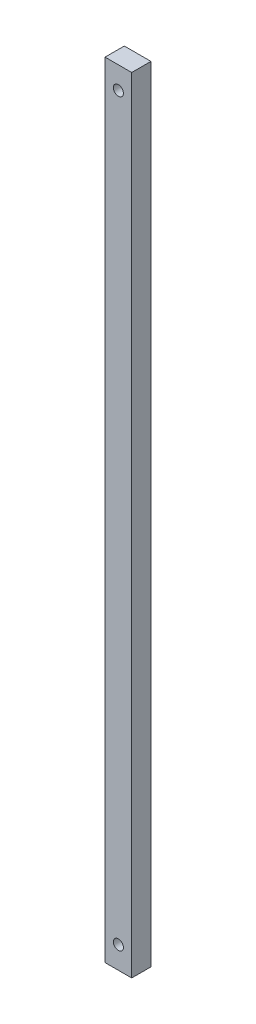
ISO-10303-21;
HEADER;
FILE_DESCRIPTION(('STEP AP214'),'2;1');
FILE_NAME('part.step','',(''),(''),'','','');
FILE_SCHEMA(('AUTOMOTIVE_DESIGN { 1 0 10303 214 1 1 1 1 }'));
ENDSEC;
DATA;
#1=APPLICATION_CONTEXT('core data for automotive mechanical design processes');
#2=APPLICATION_PROTOCOL_DEFINITION('international standard','automotive_design',2000,#1);
#3=PRODUCT_CONTEXT('',#1,'mechanical');
#4=PRODUCT('Part','Part','',(#3));
#5=PRODUCT_RELATED_PRODUCT_CATEGORY('part','',(#4));
#6=PRODUCT_DEFINITION_FORMATION('','',#4);
#7=PRODUCT_DEFINITION_CONTEXT('part definition',#1,'design');
#8=PRODUCT_DEFINITION('design','',#6,#7);
#9=PRODUCT_DEFINITION_SHAPE('','',#8);
#10=(LENGTH_UNIT() NAMED_UNIT(*) SI_UNIT(.MILLI.,.METRE.));
#11=(NAMED_UNIT(*) PLANE_ANGLE_UNIT() SI_UNIT($,.RADIAN.));
#12=(NAMED_UNIT(*) SI_UNIT($,.STERADIAN.) SOLID_ANGLE_UNIT());
#13=UNCERTAINTY_MEASURE_WITH_UNIT(LENGTH_MEASURE(1.E-05),#10,'distance_accuracy_value','');
#14=(GEOMETRIC_REPRESENTATION_CONTEXT(3) GLOBAL_UNCERTAINTY_ASSIGNED_CONTEXT((#13)) GLOBAL_UNIT_ASSIGNED_CONTEXT((#10,
#11,#12)) REPRESENTATION_CONTEXT('',''));
#15=CARTESIAN_POINT('',(0.,0.,0.));
#16=DIRECTION('',(0.,0.,1.));
#17=DIRECTION('',(1.,0.,0.));
#18=AXIS2_PLACEMENT_3D('',#15,#16,#17);
#19=CARTESIAN_POINT('',(0.,0.,6.5));
#20=DIRECTION('',(1.,0.,0.));
#21=DIRECTION('',(0.,1.,0.));
#22=AXIS2_PLACEMENT_3D('',#19,#20,#21);
#23=PLANE('',#22);
#24=DIRECTION('',(0.,-1.,0.));
#25=VECTOR('',#24,1.);
#26=CARTESIAN_POINT('',(0.,0.,0.));
#27=LINE('',#26,#25);
#28=CARTESIAN_POINT('',(0.,265.,0.));
#29=VERTEX_POINT('',#28);
#30=CARTESIAN_POINT('',(0.,0.,0.));
#31=VERTEX_POINT('',#30);
#32=EDGE_CURVE('E101',#29,#31,#27,.T.);
#33=ORIENTED_EDGE('',*,*,#32,.T.);
#34=DIRECTION('',(0.,0.,-1.));
#35=VECTOR('',#34,1.);
#36=CARTESIAN_POINT('',(0.,0.,6.5));
#37=LINE('',#36,#35);
#38=CARTESIAN_POINT('',(0.,0.,6.5));
#39=VERTEX_POINT('',#38);
#40=EDGE_CURVE('E11',#39,#31,#37,.T.);
#41=ORIENTED_EDGE('',*,*,#40,.F.);
#42=DIRECTION('',(0.,-1.,0.));
#43=VECTOR('',#42,1.);
#44=CARTESIAN_POINT('',(0.,0.,6.5));
#45=LINE('',#44,#43);
#46=CARTESIAN_POINT('',(0.,265.,6.5));
#47=VERTEX_POINT('',#46);
#48=EDGE_CURVE('E88',#47,#39,#45,.T.);
#49=ORIENTED_EDGE('',*,*,#48,.F.);
#50=DIRECTION('',(0.,0.,-1.));
#51=VECTOR('',#50,1.);
#52=CARTESIAN_POINT('',(0.,265.,6.5));
#53=LINE('',#52,#51);
#54=EDGE_CURVE('E97',#47,#29,#53,.T.);
#55=ORIENTED_EDGE('',*,*,#54,.T.);
#56=EDGE_LOOP('',(#33,#41,#49,#55));
#57=FACE_BOUND('',#56,.T.);
#58=ADVANCED_FACE('F35',(#57),#23,.F.);
#59=CARTESIAN_POINT('',(0.,0.,6.5));
#60=DIRECTION('',(0.,1.,0.));
#61=DIRECTION('',(0.,0.,1.));
#62=AXIS2_PLACEMENT_3D('',#59,#60,#61);
#63=PLANE('',#62);
#64=DIRECTION('',(1.,0.,0.));
#65=VECTOR('',#64,1.);
#66=CARTESIAN_POINT('',(0.,0.,0.));
#67=LINE('',#66,#65);
#68=CARTESIAN_POINT('',(9.,0.,0.));
#69=VERTEX_POINT('',#68);
#70=EDGE_CURVE('E92',#31,#69,#67,.T.);
#71=ORIENTED_EDGE('',*,*,#70,.T.);
#72=DIRECTION('',(0.,0.,-1.));
#73=VECTOR('',#72,1.);
#74=CARTESIAN_POINT('',(9.,0.,6.5));
#75=LINE('',#74,#73);
#76=CARTESIAN_POINT('',(9.,0.,6.5));
#77=VERTEX_POINT('',#76);
#78=EDGE_CURVE('E44',#77,#69,#75,.T.);
#79=ORIENTED_EDGE('',*,*,#78,.F.);
#80=DIRECTION('',(1.,0.,0.));
#81=VECTOR('',#80,1.);
#82=CARTESIAN_POINT('',(0.,0.,6.5));
#83=LINE('',#82,#81);
#84=EDGE_CURVE('E83',#39,#77,#83,.T.);
#85=ORIENTED_EDGE('',*,*,#84,.F.);
#86=ORIENTED_EDGE('',*,*,#40,.T.);
#87=EDGE_LOOP('',(#71,#79,#85,#86));
#88=FACE_BOUND('',#87,.T.);
#89=ADVANCED_FACE('F91',(#88),#63,.F.);
#90=CARTESIAN_POINT('',(9.,0.,6.5));
#91=DIRECTION('',(-1.,0.,0.));
#92=DIRECTION('',(0.,-1.,0.));
#93=AXIS2_PLACEMENT_3D('',#90,#91,#92);
#94=PLANE('',#93);
#95=DIRECTION('',(0.,1.,0.));
#96=VECTOR('',#95,1.);
#97=CARTESIAN_POINT('',(9.,0.,0.));
#98=LINE('',#97,#96);
#99=CARTESIAN_POINT('',(8.99999999999995,265.,0.));
#100=VERTEX_POINT('',#99);
#101=EDGE_CURVE('E70',#69,#100,#98,.T.);
#102=ORIENTED_EDGE('',*,*,#101,.T.);
#103=DIRECTION('',(0.,0.,-1.));
#104=VECTOR('',#103,1.);
#105=CARTESIAN_POINT('',(8.99999999999995,265.,6.5));
#106=LINE('',#105,#104);
#107=CARTESIAN_POINT('',(8.99999999999995,265.,6.5));
#108=VERTEX_POINT('',#107);
#109=EDGE_CURVE('E93',#108,#100,#106,.T.);
#110=ORIENTED_EDGE('',*,*,#109,.F.);
#111=DIRECTION('',(0.,1.,0.));
#112=VECTOR('',#111,1.);
#113=CARTESIAN_POINT('',(9.,0.,6.5));
#114=LINE('',#113,#112);
#115=EDGE_CURVE('E86',#77,#108,#114,.T.);
#116=ORIENTED_EDGE('',*,*,#115,.F.);
#117=ORIENTED_EDGE('',*,*,#78,.T.);
#118=EDGE_LOOP('',(#102,#110,#116,#117));
#119=FACE_BOUND('',#118,.T.);
#120=ADVANCED_FACE('F95',(#119),#94,.F.);
#121=CARTESIAN_POINT('',(0.,265.,6.5));
#122=DIRECTION('',(0.,-1.,0.));
#123=DIRECTION('',(0.,0.,-1.));
#124=AXIS2_PLACEMENT_3D('',#121,#122,#123);
#125=PLANE('',#124);
#126=DIRECTION('',(-1.,0.,0.));
#127=VECTOR('',#126,1.);
#128=CARTESIAN_POINT('',(0.,265.,0.));
#129=LINE('',#128,#127);
#130=EDGE_CURVE('E76',#100,#29,#129,.T.);
#131=ORIENTED_EDGE('',*,*,#130,.T.);
#132=ORIENTED_EDGE('',*,*,#54,.F.);
#133=DIRECTION('',(-1.,0.,0.));
#134=VECTOR('',#133,1.);
#135=CARTESIAN_POINT('',(0.,265.,6.5));
#136=LINE('',#135,#134);
#137=EDGE_CURVE('E53',#108,#47,#136,.T.);
#138=ORIENTED_EDGE('',*,*,#137,.F.);
#139=ORIENTED_EDGE('',*,*,#109,.T.);
#140=EDGE_LOOP('',(#131,#132,#138,#139));
#141=FACE_BOUND('',#140,.T.);
#142=ADVANCED_FACE('F145',(#141),#125,.F.);
#143=CARTESIAN_POINT('',(0.,0.,6.5));
#144=DIRECTION('',(0.,0.,-1.));
#145=DIRECTION('',(-1.,0.,0.));
#146=AXIS2_PLACEMENT_3D('',#143,#144,#145);
#147=PLANE('',#146);
#148=CARTESIAN_POINT('',(4.49999999999995,7.5,6.5));
#149=DIRECTION('',(0.,0.,-1.));
#150=DIRECTION('',(-1.,0.,0.));
#151=AXIS2_PLACEMENT_3D('',#148,#149,#150);
#152=CIRCLE('',#151,1.7);
#153=CARTESIAN_POINT('',(2.79999999999995,7.5,6.5));
#154=VERTEX_POINT('',#153);
#155=EDGE_CURVE('E38',#154,#154,#152,.T.);
#156=ORIENTED_EDGE('',*,*,#155,.T.);
#157=EDGE_LOOP('',(#156));
#158=FACE_BOUND('',#157,.T.);
#159=CARTESIAN_POINT('',(4.49999999999995,257.5,6.5));
#160=DIRECTION('',(0.,0.,-1.));
#161=DIRECTION('',(-1.,0.,0.));
#162=AXIS2_PLACEMENT_3D('',#159,#160,#161);
#163=CIRCLE('',#162,1.7);
#164=CARTESIAN_POINT('',(2.79999999999995,257.5,6.5));
#165=VERTEX_POINT('',#164);
#166=EDGE_CURVE('E104',#165,#165,#163,.T.);
#167=ORIENTED_EDGE('',*,*,#166,.T.);
#168=EDGE_LOOP('',(#167));
#169=FACE_BOUND('',#168,.T.);
#170=ORIENTED_EDGE('',*,*,#48,.T.);
#171=ORIENTED_EDGE('',*,*,#84,.T.);
#172=ORIENTED_EDGE('',*,*,#115,.T.);
#173=ORIENTED_EDGE('',*,*,#137,.T.);
#174=EDGE_LOOP('',(#170,#171,#172,#173));
#175=FACE_BOUND('',#174,.T.);
#176=ADVANCED_FACE('F84',(#158,#169,#175),#147,.F.);
#177=CARTESIAN_POINT('',(0.,0.,0.));
#178=DIRECTION('',(0.,0.,-1.));
#179=DIRECTION('',(-1.,0.,0.));
#180=AXIS2_PLACEMENT_3D('',#177,#178,#179);
#181=PLANE('',#180);
#182=CARTESIAN_POINT('',(4.49999999999995,7.5,0.));
#183=DIRECTION('',(0.,0.,-1.));
#184=DIRECTION('',(-1.,0.,0.));
#185=AXIS2_PLACEMENT_3D('',#182,#183,#184);
#186=CIRCLE('',#185,3.25);
#187=CARTESIAN_POINT('',(1.24999999999995,7.5,0.));
#188=VERTEX_POINT('',#187);
#189=EDGE_CURVE('E130',#188,#188,#186,.T.);
#190=ORIENTED_EDGE('',*,*,#189,.F.);
#191=EDGE_LOOP('',(#190));
#192=FACE_BOUND('',#191,.T.);
#193=CARTESIAN_POINT('',(4.49999999999995,257.5,0.));
#194=DIRECTION('',(0.,0.,-1.));
#195=DIRECTION('',(-1.,0.,0.));
#196=AXIS2_PLACEMENT_3D('',#193,#194,#195);
#197=CIRCLE('',#196,3.25);
#198=CARTESIAN_POINT('',(1.24999999999995,257.5,0.));
#199=VERTEX_POINT('',#198);
#200=EDGE_CURVE('E119',#199,#199,#197,.T.);
#201=ORIENTED_EDGE('',*,*,#200,.F.);
#202=EDGE_LOOP('',(#201));
#203=FACE_BOUND('',#202,.T.);
#204=ORIENTED_EDGE('',*,*,#32,.F.);
#205=ORIENTED_EDGE('',*,*,#130,.F.);
#206=ORIENTED_EDGE('',*,*,#101,.F.);
#207=ORIENTED_EDGE('',*,*,#70,.F.);
#208=EDGE_LOOP('',(#204,#205,#206,#207));
#209=FACE_BOUND('',#208,.T.);
#210=ADVANCED_FACE('F136',(#192,#203,#209),#181,.T.);
#211=CARTESIAN_POINT('',(4.49999999999995,257.5,0.));
#212=DIRECTION('',(0.,0.,-1.));
#213=DIRECTION('',(-1.,0.,0.));
#214=AXIS2_PLACEMENT_3D('',#211,#212,#213);
#215=CYLINDRICAL_SURFACE('',#214,1.7);
#216=CARTESIAN_POINT('',(4.49999999999995,257.5,3.4));
#217=DIRECTION('',(0.,0.,-1.));
#218=DIRECTION('',(-1.,0.,0.));
#219=AXIS2_PLACEMENT_3D('',#216,#217,#218);
#220=CIRCLE('',#219,1.7);
#221=CARTESIAN_POINT('',(2.79999999999995,257.5,3.4));
#222=VERTEX_POINT('',#221);
#223=EDGE_CURVE('E110',#222,#222,#220,.T.);
#224=ORIENTED_EDGE('',*,*,#223,.T.);
#225=EDGE_LOOP('',(#224));
#226=FACE_BOUND('',#225,.T.);
#227=ORIENTED_EDGE('',*,*,#166,.F.);
#228=EDGE_LOOP('',(#227));
#229=FACE_BOUND('',#228,.T.);
#230=ADVANCED_FACE('F139',(#226,#229),#215,.F.);
#231=CARTESIAN_POINT('',(6.19999999999995,257.5,3.4));
#232=DIRECTION('',(0.,0.,1.));
#233=DIRECTION('',(1.,0.,0.));
#234=AXIS2_PLACEMENT_3D('',#231,#232,#233);
#235=PLANE('',#234);
#236=ORIENTED_EDGE('',*,*,#223,.F.);
#237=EDGE_LOOP('',(#236));
#238=FACE_BOUND('',#237,.T.);
#239=CARTESIAN_POINT('',(4.49999999999995,257.5,3.4));
#240=DIRECTION('',(0.,0.,-1.));
#241=DIRECTION('',(-1.,0.,0.));
#242=AXIS2_PLACEMENT_3D('',#239,#240,#241);
#243=CIRCLE('',#242,3.25);
#244=CARTESIAN_POINT('',(1.24999999999995,257.5,3.4));
#245=VERTEX_POINT('',#244);
#246=EDGE_CURVE('E114',#245,#245,#243,.T.);
#247=ORIENTED_EDGE('',*,*,#246,.T.);
#248=EDGE_LOOP('',(#247));
#249=FACE_BOUND('',#248,.T.);
#250=ADVANCED_FACE('F190',(#238,#249),#235,.F.);
#251=CARTESIAN_POINT('',(4.49999999999995,257.5,0.));
#252=DIRECTION('',(0.,0.,-1.));
#253=DIRECTION('',(-1.,0.,0.));
#254=AXIS2_PLACEMENT_3D('',#251,#252,#253);
#255=CYLINDRICAL_SURFACE('',#254,3.25);
#256=ORIENTED_EDGE('',*,*,#246,.F.);
#257=EDGE_LOOP('',(#256));
#258=FACE_BOUND('',#257,.T.);
#259=ORIENTED_EDGE('',*,*,#200,.T.);
#260=EDGE_LOOP('',(#259));
#261=FACE_BOUND('',#260,.T.);
#262=ADVANCED_FACE('F199',(#258,#261),#255,.F.);
#263=CARTESIAN_POINT('',(4.49999999999995,7.5,0.));
#264=DIRECTION('',(0.,0.,-1.));
#265=DIRECTION('',(-1.,0.,0.));
#266=AXIS2_PLACEMENT_3D('',#263,#264,#265);
#267=CYLINDRICAL_SURFACE('',#266,1.7);
#268=CARTESIAN_POINT('',(4.49999999999995,7.5,3.4));
#269=DIRECTION('',(0.,0.,-1.));
#270=DIRECTION('',(-1.,0.,0.));
#271=AXIS2_PLACEMENT_3D('',#268,#269,#270);
#272=CIRCLE('',#271,1.7);
#273=CARTESIAN_POINT('',(2.79999999999995,7.5,3.4));
#274=VERTEX_POINT('',#273);
#275=EDGE_CURVE('E124',#274,#274,#272,.T.);
#276=ORIENTED_EDGE('',*,*,#275,.T.);
#277=EDGE_LOOP('',(#276));
#278=FACE_BOUND('',#277,.T.);
#279=ORIENTED_EDGE('',*,*,#155,.F.);
#280=EDGE_LOOP('',(#279));
#281=FACE_BOUND('',#280,.T.);
#282=ADVANCED_FACE('F209',(#278,#281),#267,.F.);
#283=CARTESIAN_POINT('',(6.19999999999995,7.5,3.4));
#284=DIRECTION('',(0.,0.,1.));
#285=DIRECTION('',(1.,0.,0.));
#286=AXIS2_PLACEMENT_3D('',#283,#284,#285);
#287=PLANE('',#286);
#288=ORIENTED_EDGE('',*,*,#275,.F.);
#289=EDGE_LOOP('',(#288));
#290=FACE_BOUND('',#289,.T.);
#291=CARTESIAN_POINT('',(4.49999999999995,7.5,3.4));
#292=DIRECTION('',(0.,0.,-1.));
#293=DIRECTION('',(-1.,0.,0.));
#294=AXIS2_PLACEMENT_3D('',#291,#292,#293);
#295=CIRCLE('',#294,3.25);
#296=CARTESIAN_POINT('',(1.24999999999995,7.5,3.4));
#297=VERTEX_POINT('',#296);
#298=EDGE_CURVE('E127',#297,#297,#295,.T.);
#299=ORIENTED_EDGE('',*,*,#298,.T.);
#300=EDGE_LOOP('',(#299));
#301=FACE_BOUND('',#300,.T.);
#302=ADVANCED_FACE('F219',(#290,#301),#287,.F.);
#303=CARTESIAN_POINT('',(4.49999999999995,7.5,0.));
#304=DIRECTION('',(0.,0.,-1.));
#305=DIRECTION('',(-1.,0.,0.));
#306=AXIS2_PLACEMENT_3D('',#303,#304,#305);
#307=CYLINDRICAL_SURFACE('',#306,3.25);
#308=ORIENTED_EDGE('',*,*,#298,.F.);
#309=EDGE_LOOP('',(#308));
#310=FACE_BOUND('',#309,.T.);
#311=ORIENTED_EDGE('',*,*,#189,.T.);
#312=EDGE_LOOP('',(#311));
#313=FACE_BOUND('',#312,.T.);
#314=ADVANCED_FACE('F134',(#310,#313),#307,.F.);
#315=CLOSED_SHELL('',(#58,#89,#120,#142,#176,#210,#230,#250,#262,#282,#302,#314));
#316=MANIFOLD_SOLID_BREP('B2',#315);
#317=ADVANCED_BREP_SHAPE_REPRESENTATION('',(#18,#316),#14);
#318=SHAPE_DEFINITION_REPRESENTATION(#9,#317);
ENDSEC;
END-ISO-10303-21;
